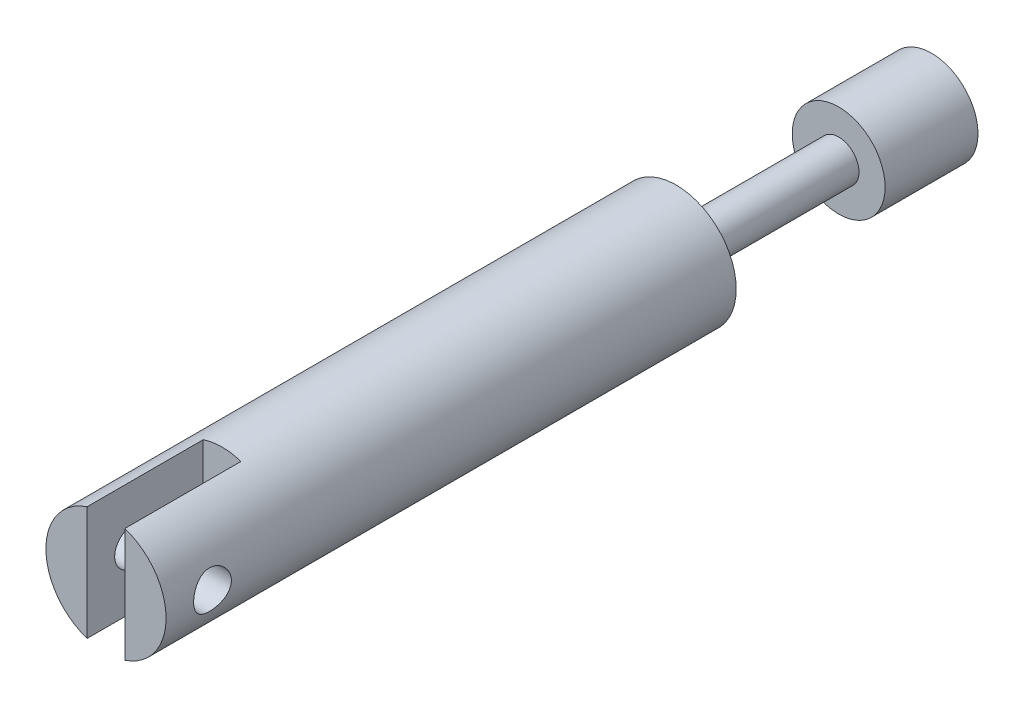
ISO-10303-21;
HEADER;
FILE_DESCRIPTION(('STEP AP214'),'2;1');
FILE_NAME('part.step','',(''),(''),'','','');
FILE_SCHEMA(('AUTOMOTIVE_DESIGN { 1 0 10303 214 1 1 1 1 }'));
ENDSEC;
DATA;
#1=APPLICATION_CONTEXT('core data for automotive mechanical design processes');
#2=APPLICATION_PROTOCOL_DEFINITION('international standard','automotive_design',2000,#1);
#3=PRODUCT_CONTEXT('',#1,'mechanical');
#4=PRODUCT('Part','Part','',(#3));
#5=PRODUCT_RELATED_PRODUCT_CATEGORY('part','',(#4));
#6=PRODUCT_DEFINITION_FORMATION('','',#4);
#7=PRODUCT_DEFINITION_CONTEXT('part definition',#1,'design');
#8=PRODUCT_DEFINITION('design','',#6,#7);
#9=PRODUCT_DEFINITION_SHAPE('','',#8);
#10=(LENGTH_UNIT() NAMED_UNIT(*) SI_UNIT(.MILLI.,.METRE.));
#11=(NAMED_UNIT(*) PLANE_ANGLE_UNIT() SI_UNIT($,.RADIAN.));
#12=(NAMED_UNIT(*) SI_UNIT($,.STERADIAN.) SOLID_ANGLE_UNIT());
#13=UNCERTAINTY_MEASURE_WITH_UNIT(LENGTH_MEASURE(1.E-05),#10,'distance_accuracy_value','');
#14=(GEOMETRIC_REPRESENTATION_CONTEXT(3) GLOBAL_UNCERTAINTY_ASSIGNED_CONTEXT((#13)) GLOBAL_UNIT_ASSIGNED_CONTEXT((#10,
#11,#12)) REPRESENTATION_CONTEXT('',''));
#15=CARTESIAN_POINT('',(0.,0.,0.));
#16=DIRECTION('',(0.,0.,1.));
#17=DIRECTION('',(1.,0.,0.));
#18=AXIS2_PLACEMENT_3D('',#15,#16,#17);
#19=CARTESIAN_POINT('',(0.,0.,0.));
#20=DIRECTION('',(0.,0.,1.));
#21=DIRECTION('',(1.,0.,0.));
#22=AXIS2_PLACEMENT_3D('',#19,#20,#21);
#23=PLANE('',#22);
#24=DIRECTION('',(0.,1.,0.));
#25=VECTOR('',#24,1.);
#26=CARTESIAN_POINT('',(1.625,-5.5,0.));
#27=LINE('',#26,#25);
#28=CARTESIAN_POINT('',(1.625,-4.9132473986153,0.));
#29=VERTEX_POINT('',#28);
#30=CARTESIAN_POINT('',(1.625,4.9132473986153,0.));
#31=VERTEX_POINT('',#30);
#32=EDGE_CURVE('E82',#29,#31,#27,.T.);
#33=ORIENTED_EDGE('',*,*,#32,.F.);
#34=CARTESIAN_POINT('',(0.,0.,0.));
#35=DIRECTION('',(0.,0.,1.));
#36=DIRECTION('',(1.,0.,0.));
#37=AXIS2_PLACEMENT_3D('',#34,#35,#36);
#38=CIRCLE('',#37,5.175);
#39=EDGE_CURVE('E89',#29,#31,#38,.T.);
#40=ORIENTED_EDGE('',*,*,#39,.T.);
#41=EDGE_LOOP('',(#33,#40));
#42=FACE_BOUND('',#41,.T.);
#43=ADVANCED_FACE('F40',(#42),#23,.T.);
#44=CARTESIAN_POINT('',(0.,0.,-71.1));
#45=DIRECTION('',(0.,0.,1.));
#46=DIRECTION('',(1.,0.,0.));
#47=AXIS2_PLACEMENT_3D('',#44,#45,#46);
#48=PLANE('',#47);
#49=CARTESIAN_POINT('',(0.,0.,-71.1));
#50=DIRECTION('',(0.,0.,1.));
#51=DIRECTION('',(1.,0.,0.));
#52=AXIS2_PLACEMENT_3D('',#49,#50,#51);
#53=CIRCLE('',#52,4.);
#54=CARTESIAN_POINT('',(4.,0.,-71.1));
#55=VERTEX_POINT('',#54);
#56=EDGE_CURVE('E105',#55,#55,#53,.T.);
#57=ORIENTED_EDGE('',*,*,#56,.F.);
#58=EDGE_LOOP('',(#57));
#59=FACE_BOUND('',#58,.T.);
#60=ADVANCED_FACE('F139',(#59),#48,.F.);
#61=CARTESIAN_POINT('',(0.,0.,-49.1));
#62=DIRECTION('',(0.,0.,1.));
#63=DIRECTION('',(1.,0.,0.));
#64=AXIS2_PLACEMENT_3D('',#61,#62,#63);
#65=CYLINDRICAL_SURFACE('',#64,4.);
#66=ORIENTED_EDGE('',*,*,#56,.T.);
#67=EDGE_LOOP('',(#66));
#68=FACE_BOUND('',#67,.T.);
#69=CARTESIAN_POINT('',(0.,0.,-63.1));
#70=DIRECTION('',(0.,0.,1.));
#71=DIRECTION('',(1.,0.,0.));
#72=AXIS2_PLACEMENT_3D('',#69,#70,#71);
#73=CIRCLE('',#72,4.);
#74=CARTESIAN_POINT('',(4.,0.,-63.1));
#75=VERTEX_POINT('',#74);
#76=EDGE_CURVE('E129',#75,#75,#73,.T.);
#77=ORIENTED_EDGE('',*,*,#76,.F.);
#78=EDGE_LOOP('',(#77));
#79=FACE_BOUND('',#78,.T.);
#80=ADVANCED_FACE('F136',(#68,#79),#65,.T.);
#81=CARTESIAN_POINT('',(0.,0.,-63.1));
#82=DIRECTION('',(0.,0.,1.));
#83=DIRECTION('',(1.,0.,0.));
#84=AXIS2_PLACEMENT_3D('',#81,#82,#83);
#85=PLANE('',#84);
#86=ORIENTED_EDGE('',*,*,#76,.T.);
#87=EDGE_LOOP('',(#86));
#88=FACE_BOUND('',#87,.T.);
#89=CARTESIAN_POINT('',(0.,0.,-63.1));
#90=DIRECTION('',(0.,0.,1.));
#91=DIRECTION('',(1.,0.,0.));
#92=AXIS2_PLACEMENT_3D('',#89,#90,#91);
#93=CIRCLE('',#92,1.75);
#94=CARTESIAN_POINT('',(1.75,0.,-63.1));
#95=VERTEX_POINT('',#94);
#96=EDGE_CURVE('E127',#95,#95,#93,.T.);
#97=ORIENTED_EDGE('',*,*,#96,.F.);
#98=EDGE_LOOP('',(#97));
#99=FACE_BOUND('',#98,.T.);
#100=ADVANCED_FACE('F146',(#88,#99),#85,.T.);
#101=CARTESIAN_POINT('',(0.,0.,-49.1));
#102=DIRECTION('',(0.,0.,1.));
#103=DIRECTION('',(1.,0.,0.));
#104=AXIS2_PLACEMENT_3D('',#101,#102,#103);
#105=CYLINDRICAL_SURFACE('',#104,1.75);
#106=ORIENTED_EDGE('',*,*,#96,.T.);
#107=EDGE_LOOP('',(#106));
#108=FACE_BOUND('',#107,.T.);
#109=CARTESIAN_POINT('',(0.,0.,-49.1));
#110=DIRECTION('',(0.,0.,1.));
#111=DIRECTION('',(1.,0.,0.));
#112=AXIS2_PLACEMENT_3D('',#109,#110,#111);
#113=CIRCLE('',#112,1.75);
#114=CARTESIAN_POINT('',(1.75,0.,-49.1));
#115=VERTEX_POINT('',#114);
#116=EDGE_CURVE('E109',#115,#115,#113,.T.);
#117=ORIENTED_EDGE('',*,*,#116,.F.);
#118=EDGE_LOOP('',(#117));
#119=FACE_BOUND('',#118,.T.);
#120=ADVANCED_FACE('F150',(#108,#119),#105,.T.);
#121=DIRECTION('',(0.,-1.,0.));
#122=VECTOR('',#121,1.);
#123=CARTESIAN_POINT('',(-1.625,-5.5,0.));
#124=LINE('',#123,#122);
#125=CARTESIAN_POINT('',(-1.625,4.9132473986153,0.));
#126=VERTEX_POINT('',#125);
#127=CARTESIAN_POINT('',(-1.625,-4.9132473986153,0.));
#128=VERTEX_POINT('',#127);
#129=EDGE_CURVE('E90',#126,#128,#124,.T.);
#130=ORIENTED_EDGE('',*,*,#129,.F.);
#131=EDGE_CURVE('E97',#126,#128,#38,.T.);
#132=ORIENTED_EDGE('',*,*,#131,.T.);
#133=EDGE_LOOP('',(#130,#132));
#134=FACE_BOUND('',#133,.T.);
#135=ADVANCED_FACE('F121',(#134),#23,.T.);
#136=CARTESIAN_POINT('',(0.,0.,-49.1));
#137=DIRECTION('',(0.,0.,1.));
#138=DIRECTION('',(1.,0.,0.));
#139=AXIS2_PLACEMENT_3D('',#136,#137,#138);
#140=CYLINDRICAL_SURFACE('',#139,5.175);
#141=CARTESIAN_POINT('',(-5.175,0.,-5.625));
#142=CARTESIAN_POINT('',(-5.17499959983047,-0.0889493776523155,-5.62499948440877));
#143=CARTESIAN_POINT('',(-5.17268505675241,-0.177904241665492,-5.61767257760745));
#144=CARTESIAN_POINT('',(-5.16367873147391,-0.353211227384269,-5.58863625969267));
#145=CARTESIAN_POINT('',(-5.15698599691395,-0.439562778532089,-5.56692371935274));
#146=CARTESIAN_POINT('',(-5.13995414666757,-0.607109890595455,-5.50992147272883));
#147=CARTESIAN_POINT('',(-5.1296207094183,-0.688313249788196,-5.47465290216195));
#148=CARTESIAN_POINT('',(-5.10637352802269,-0.843653451679668,-5.3916300613458));
#149=CARTESIAN_POINT('',(-5.09345936979124,-0.917789157527114,-5.34387378702389));
#150=CARTESIAN_POINT('',(-5.06597076052829,-1.05919938443934,-5.2356653912615));
#151=CARTESIAN_POINT('',(-5.05135987802509,-1.12622286992396,-5.17489449962652));
#152=CARTESIAN_POINT('',(-5.02233481509282,-1.24931396060239,-5.04306058729802));
#153=CARTESIAN_POINT('',(-5.00792067220902,-1.30537950106856,-4.97199563135086));
#154=CARTESIAN_POINT('',(-4.98052949600537,-1.40632942653925,-4.81941153311028));
#155=CARTESIAN_POINT('',(-4.96759738840324,-1.45089931208157,-4.73767548649231));
#156=CARTESIAN_POINT('',(-4.94518287407581,-1.52555621007292,-4.56739636124243));
#157=CARTESIAN_POINT('',(-4.93569954877889,-1.55564707965025,-4.47885510277774));
#158=CARTESIAN_POINT('',(-4.92163758993859,-1.59957156723524,-4.30031328367556));
#159=CARTESIAN_POINT('',(-4.91691873741038,-1.61387119844563,-4.21043872321179));
#160=CARTESIAN_POINT('',(-4.91250380140087,-1.62726325588285,-4.0294517757376));
#161=CARTESIAN_POINT('',(-4.91280636774864,-1.62635976995875,-3.93833972804902));
#162=CARTESIAN_POINT('',(-4.91827637600034,-1.60973553686012,-3.76132726450667));
#163=CARTESIAN_POINT('',(-4.92324895093923,-1.59460827957634,-3.6753640726806));
#164=CARTESIAN_POINT('',(-4.93718196386765,-1.55092858896977,-3.50726342403781));
#165=CARTESIAN_POINT('',(-4.9461428294196,-1.52237471623574,-3.42512637844409));
#166=CARTESIAN_POINT('',(-4.96719135901205,-1.45223539816551,-3.2656004079079));
#167=CARTESIAN_POINT('',(-4.97932310152659,-1.41046434222798,-3.18829915667181));
#168=CARTESIAN_POINT('',(-5.00532637080404,-1.31520528425443,-3.04160901253025));
#169=CARTESIAN_POINT('',(-5.01919835276622,-1.26171421383878,-2.97222219892577));
#170=CARTESIAN_POINT('',(-5.04789976764213,-1.14162562887212,-2.8399767279075));
#171=CARTESIAN_POINT('',(-5.06274389375816,-1.07453849677679,-2.77756504341678));
#172=CARTESIAN_POINT('',(-5.09115470603233,-0.930665538842489,-2.66476868132937));
#173=CARTESIAN_POINT('',(-5.10472129566394,-0.853878981171001,-2.61438491208219));
#174=CARTESIAN_POINT('',(-5.12919328803005,-0.691919377393082,-2.52676778355));
#175=CARTESIAN_POINT('',(-5.14007671744089,-0.606684612838595,-2.48964195773188));
#176=CARTESIAN_POINT('',(-5.15779745097689,-0.430758215311956,-2.43038849985547));
#177=CARTESIAN_POINT('',(-5.16463599599958,-0.340068265308212,-2.40825626773007));
#178=CARTESIAN_POINT('',(-5.17329634969086,-0.15959915935493,-2.38038179255371));
#179=CARTESIAN_POINT('',(-5.17530324612896,-0.0699221971993209,-2.37403453788453));
#180=CARTESIAN_POINT('',(-5.17462212762041,0.109225618040898,-2.37620312590349));
#181=CARTESIAN_POINT('',(-5.17193480589307,0.198696499604779,-2.38471677400566));
#182=CARTESIAN_POINT('',(-5.16228886759816,0.372552593156562,-2.41588026091358));
#183=CARTESIAN_POINT('',(-5.15543934067453,0.457009112972064,-2.43816929922527));
#184=CARTESIAN_POINT('',(-5.13827154794756,0.620959413438734,-2.49580985009886));
#185=CARTESIAN_POINT('',(-5.12795285253228,0.700452577995752,-2.53116298053452));
#186=CARTESIAN_POINT('',(-5.1045919516232,0.854388458077668,-2.61489695183573));
#187=CARTESIAN_POINT('',(-5.09148915672815,0.928659491034174,-2.66357604221924));
#188=CARTESIAN_POINT('',(-5.06405747823764,1.06818115113378,-2.77222282447313));
#189=CARTESIAN_POINT('',(-5.04972825964499,1.13342930086743,-2.8321936060668));
#190=CARTESIAN_POINT('',(-5.02073633599312,1.25576499066225,-2.96456719404252));
#191=CARTESIAN_POINT('',(-5.00608324554366,1.31242125979291,-3.03737158452511));
#192=CARTESIAN_POINT('',(-4.97870168489054,1.41275210970802,-3.1917726601381));
#193=CARTESIAN_POINT('',(-4.9659731869061,1.45642687788442,-3.2733692183277));
#194=CARTESIAN_POINT('',(-4.94402224849047,1.52928751257111,-3.44288247036985));
#195=CARTESIAN_POINT('',(-4.93478665135213,1.55852787886185,-3.53077393384997));
#196=CARTESIAN_POINT('',(-4.92094971504254,1.6016874094143,-3.7105829766703));
#197=CARTESIAN_POINT('',(-4.91634659035592,1.61561247691511,-3.80249899054379));
#198=CARTESIAN_POINT('',(-4.91248305571621,1.62731954769172,-3.98323596671762));
#199=CARTESIAN_POINT('',(-4.91298829292194,1.62580961556396,-4.07200661795501));
#200=CARTESIAN_POINT('',(-4.91871453231315,1.60840119334225,-4.24796282375275));
#201=CARTESIAN_POINT('',(-4.92393531050341,1.59250338669369,-4.33514845340331));
#202=CARTESIAN_POINT('',(-4.93833984226244,1.5472464749726,-4.50418009843994));
#203=CARTESIAN_POINT('',(-4.94746327448843,1.51809185824698,-4.58608639377386));
#204=CARTESIAN_POINT('',(-4.96862922388875,1.44731023360019,-4.7439100104367));
#205=CARTESIAN_POINT('',(-4.98067233886488,1.40568067103514,-4.8198261010532));
#206=CARTESIAN_POINT('',(-5.00691340583145,1.3092105192683,-4.96675649521953));
#207=CARTESIAN_POINT('',(-5.02117762173442,1.25391355708287,-5.03745929003676));
#208=CARTESIAN_POINT('',(-5.04995092122263,1.13247909042643,-5.168811349176));
#209=CARTESIAN_POINT('',(-5.06446006961637,1.06633867516089,-5.22945790520503));
#210=CARTESIAN_POINT('',(-5.09266432135441,0.922462279729688,-5.34098551224747));
#211=CARTESIAN_POINT('',(-5.10631661089813,0.844415062170003,-5.39147709331462));
#212=CARTESIAN_POINT('',(-5.13072870470507,0.680512221895123,-5.47855718936791));
#213=CARTESIAN_POINT('',(-5.14148961841177,0.594659611142506,-5.51515103925682));
#214=CARTESIAN_POINT('',(-5.15817998919953,0.424829628253835,-5.57081708651198));
#215=CARTESIAN_POINT('',(-5.16443239020534,0.341272271316685,-5.59107670008895));
#216=CARTESIAN_POINT('',(-5.17284216494167,0.171811322465354,-5.61816701567929));
#217=CARTESIAN_POINT('',(-5.17500038648783,0.0859082200423746,-5.62500049796329));
#218=CARTESIAN_POINT('',(-5.175,0.,-5.625));
#219=B_SPLINE_CURVE_WITH_KNOTS('',3,(#141,#142,#143,#144,#145,#146,#147,#148,#149,#150,#151,
#152,#153,#154,#155,#156,#157,#158,#159,#160,#161,#162,#163,#164,#165,#166,#167,#168,#169,#170,
#171,#172,#173,#174,#175,#176,#177,#178,#179,#180,#181,#182,#183,#184,#185,#186,#187,#188,#189,
#190,#191,#192,#193,#194,#195,#196,#197,#198,#199,#200,#201,#202,#203,#204,#205,#206,#207,#208,
#209,#210,#211,#212,#213,#214,#215,#216,#217,#218),.UNSPECIFIED.,.T.,.F.,(4,2,2,2,2,2,2,2,2,2,2,
2,2,2,2,2,2,2,2,2,2,2,2,2,2,2,2,2,2,2,2,2,2,2,2,2,2,2,4),(0.,0.266532336360352,0.53312266905361,
0.799299025804361,1.06551812576102,1.33921069029247,1.61295477515592,1.89354108429096,
2.17405260537466,2.44604432297749,2.71796290799117,2.97901654963654,3.24009818413283,
3.50502235906277,3.77001597600068,4.04719632817766,4.3243976064288,4.60379872697632,
4.88311408778565,5.15154633647776,5.41993894775222,5.68158350781141,5.9432604811301,
6.21135528996232,6.47952356394074,6.75842757626405,7.03732756232702,7.31516629781155,
7.59289790356026,7.85794821396332,8.12298593474397,8.38406726116075,8.64520208890234,
8.91663832190983,9.18814753837283,9.46863950815224,9.74902369677562,10.0064966802002,
10.2639163407396),.UNSPECIFIED.);
#220=CARTESIAN_POINT('',(-5.175,0.,-5.625));
#221=VERTEX_POINT('',#220);
#222=EDGE_CURVE('E161',#221,#221,#219,.T.);
#223=ORIENTED_EDGE('',*,*,#222,.F.);
#224=EDGE_LOOP('',(#223));
#225=FACE_BOUND('',#224,.T.);
#226=CARTESIAN_POINT('',(5.175,0.,-5.625));
#227=CARTESIAN_POINT('',(5.17499959983047,0.0889493776523155,-5.62499948440877));
#228=CARTESIAN_POINT('',(5.17268505675241,0.177904241665492,-5.61767257760745));
#229=CARTESIAN_POINT('',(5.16367873147391,0.353211227384269,-5.58863625969267));
#230=CARTESIAN_POINT('',(5.15698599691395,0.439562778532089,-5.56692371935274));
#231=CARTESIAN_POINT('',(5.13995414666757,0.607109890595455,-5.50992147272883));
#232=CARTESIAN_POINT('',(5.1296207094183,0.688313249788196,-5.47465290216195));
#233=CARTESIAN_POINT('',(5.10637352802269,0.843653451679668,-5.3916300613458));
#234=CARTESIAN_POINT('',(5.09345936979124,0.917789157527114,-5.34387378702389));
#235=CARTESIAN_POINT('',(5.06597076052829,1.05919938443934,-5.2356653912615));
#236=CARTESIAN_POINT('',(5.05135987802509,1.12622286992396,-5.17489449962652));
#237=CARTESIAN_POINT('',(5.02233481509282,1.24931396060239,-5.04306058729802));
#238=CARTESIAN_POINT('',(5.00792067220902,1.30537950106856,-4.97199563135086));
#239=CARTESIAN_POINT('',(4.98052949600537,1.40632942653925,-4.81941153311028));
#240=CARTESIAN_POINT('',(4.96759738840324,1.45089931208157,-4.73767548649231));
#241=CARTESIAN_POINT('',(4.94518287407581,1.52555621007292,-4.56739636124243));
#242=CARTESIAN_POINT('',(4.93569954877889,1.55564707965025,-4.47885510277774));
#243=CARTESIAN_POINT('',(4.92163758993859,1.59957156723524,-4.30031328367556));
#244=CARTESIAN_POINT('',(4.91691873741038,1.61387119844563,-4.21043872321179));
#245=CARTESIAN_POINT('',(4.91250380140087,1.62726325588285,-4.0294517757376));
#246=CARTESIAN_POINT('',(4.91280636774864,1.62635976995875,-3.93833972804902));
#247=CARTESIAN_POINT('',(4.91827637600034,1.60973553686012,-3.76132726450667));
#248=CARTESIAN_POINT('',(4.92324895093923,1.59460827957634,-3.6753640726806));
#249=CARTESIAN_POINT('',(4.93718196386765,1.55092858896977,-3.50726342403781));
#250=CARTESIAN_POINT('',(4.9461428294196,1.52237471623574,-3.42512637844409));
#251=CARTESIAN_POINT('',(4.96719135901205,1.45223539816551,-3.2656004079079));
#252=CARTESIAN_POINT('',(4.97932310152659,1.41046434222798,-3.18829915667181));
#253=CARTESIAN_POINT('',(5.00532637080404,1.31520528425443,-3.04160901253025));
#254=CARTESIAN_POINT('',(5.01919835276622,1.26171421383878,-2.97222219892577));
#255=CARTESIAN_POINT('',(5.04789976764213,1.14162562887212,-2.8399767279075));
#256=CARTESIAN_POINT('',(5.06274389375816,1.07453849677679,-2.77756504341678));
#257=CARTESIAN_POINT('',(5.09115470603233,0.930665538842489,-2.66476868132937));
#258=CARTESIAN_POINT('',(5.10472129566394,0.853878981171001,-2.61438491208219));
#259=CARTESIAN_POINT('',(5.12919328803005,0.691919377393082,-2.52676778355));
#260=CARTESIAN_POINT('',(5.14007671744089,0.606684612838595,-2.48964195773188));
#261=CARTESIAN_POINT('',(5.15779745097689,0.430758215311956,-2.43038849985547));
#262=CARTESIAN_POINT('',(5.16463599599958,0.340068265308212,-2.40825626773007));
#263=CARTESIAN_POINT('',(5.17329634969086,0.15959915935493,-2.38038179255371));
#264=CARTESIAN_POINT('',(5.17530324612896,0.0699221971993209,-2.37403453788453));
#265=CARTESIAN_POINT('',(5.17462212762041,-0.109225618040898,-2.37620312590349));
#266=CARTESIAN_POINT('',(5.17193480589307,-0.198696499604779,-2.38471677400566));
#267=CARTESIAN_POINT('',(5.16228886759816,-0.372552593156562,-2.41588026091358));
#268=CARTESIAN_POINT('',(5.15543934067453,-0.457009112972064,-2.43816929922527));
#269=CARTESIAN_POINT('',(5.13827154794756,-0.620959413438734,-2.49580985009886));
#270=CARTESIAN_POINT('',(5.12795285253228,-0.700452577995752,-2.53116298053452));
#271=CARTESIAN_POINT('',(5.1045919516232,-0.854388458077668,-2.61489695183573));
#272=CARTESIAN_POINT('',(5.09148915672815,-0.928659491034174,-2.66357604221924));
#273=CARTESIAN_POINT('',(5.06405747823764,-1.06818115113378,-2.77222282447313));
#274=CARTESIAN_POINT('',(5.04972825964499,-1.13342930086743,-2.8321936060668));
#275=CARTESIAN_POINT('',(5.02073633599312,-1.25576499066225,-2.96456719404252));
#276=CARTESIAN_POINT('',(5.00608324554366,-1.31242125979291,-3.03737158452511));
#277=CARTESIAN_POINT('',(4.97870168489054,-1.41275210970802,-3.1917726601381));
#278=CARTESIAN_POINT('',(4.9659731869061,-1.45642687788442,-3.2733692183277));
#279=CARTESIAN_POINT('',(4.94402224849047,-1.52928751257111,-3.44288247036985));
#280=CARTESIAN_POINT('',(4.93478665135213,-1.55852787886185,-3.53077393384997));
#281=CARTESIAN_POINT('',(4.92094971504254,-1.6016874094143,-3.7105829766703));
#282=CARTESIAN_POINT('',(4.91634659035592,-1.61561247691511,-3.80249899054379));
#283=CARTESIAN_POINT('',(4.91248305571621,-1.62731954769172,-3.98323596671762));
#284=CARTESIAN_POINT('',(4.91298829292194,-1.62580961556396,-4.07200661795501));
#285=CARTESIAN_POINT('',(4.91871453231315,-1.60840119334225,-4.24796282375275));
#286=CARTESIAN_POINT('',(4.92393531050341,-1.59250338669369,-4.33514845340331));
#287=CARTESIAN_POINT('',(4.93833984226244,-1.5472464749726,-4.50418009843994));
#288=CARTESIAN_POINT('',(4.94746327448843,-1.51809185824698,-4.58608639377386));
#289=CARTESIAN_POINT('',(4.96862922388875,-1.44731023360019,-4.7439100104367));
#290=CARTESIAN_POINT('',(4.98067233886488,-1.40568067103514,-4.8198261010532));
#291=CARTESIAN_POINT('',(5.00691340583145,-1.3092105192683,-4.96675649521953));
#292=CARTESIAN_POINT('',(5.02117762173442,-1.25391355708287,-5.03745929003676));
#293=CARTESIAN_POINT('',(5.04995092122263,-1.13247909042643,-5.168811349176));
#294=CARTESIAN_POINT('',(5.06446006961637,-1.06633867516089,-5.22945790520503));
#295=CARTESIAN_POINT('',(5.09266432135441,-0.922462279729688,-5.34098551224747));
#296=CARTESIAN_POINT('',(5.10631661089813,-0.844415062170003,-5.39147709331462));
#297=CARTESIAN_POINT('',(5.13072870470507,-0.680512221895123,-5.47855718936791));
#298=CARTESIAN_POINT('',(5.14148961841177,-0.594659611142506,-5.51515103925682));
#299=CARTESIAN_POINT('',(5.15817998919953,-0.424829628253835,-5.57081708651198));
#300=CARTESIAN_POINT('',(5.16443239020534,-0.341272271316685,-5.59107670008895));
#301=CARTESIAN_POINT('',(5.17284216494167,-0.171811322465354,-5.61816701567929));
#302=CARTESIAN_POINT('',(5.17500038648783,-0.0859082200423746,-5.62500049796329));
#303=CARTESIAN_POINT('',(5.175,0.,-5.625));
#304=B_SPLINE_CURVE_WITH_KNOTS('',3,(#226,#227,#228,#229,#230,#231,#232,#233,#234,#235,#236,
#237,#238,#239,#240,#241,#242,#243,#244,#245,#246,#247,#248,#249,#250,#251,#252,#253,#254,#255,
#256,#257,#258,#259,#260,#261,#262,#263,#264,#265,#266,#267,#268,#269,#270,#271,#272,#273,#274,
#275,#276,#277,#278,#279,#280,#281,#282,#283,#284,#285,#286,#287,#288,#289,#290,#291,#292,#293,
#294,#295,#296,#297,#298,#299,#300,#301,#302,#303),.UNSPECIFIED.,.T.,.F.,(4,2,2,2,2,2,2,2,2,2,2,
2,2,2,2,2,2,2,2,2,2,2,2,2,2,2,2,2,2,2,2,2,2,2,2,2,2,2,4),(0.,0.266532336360352,0.53312266905361,
0.799299025804361,1.06551812576102,1.33921069029247,1.61295477515592,1.89354108429096,
2.17405260537466,2.44604432297749,2.71796290799117,2.97901654963654,3.24009818413283,
3.50502235906277,3.77001597600068,4.04719632817766,4.3243976064288,4.60379872697632,
4.88311408778565,5.15154633647776,5.41993894775222,5.68158350781141,5.9432604811301,
6.21135528996232,6.47952356394074,6.75842757626405,7.03732756232702,7.31516629781155,
7.59289790356026,7.85794821396332,8.12298593474397,8.38406726116075,8.64520208890234,
8.91663832190983,9.18814753837283,9.46863950815224,9.74902369677562,10.0064966802002,
10.2639163407396),.UNSPECIFIED.);
#305=CARTESIAN_POINT('',(5.175,0.,-5.625));
#306=VERTEX_POINT('',#305);
#307=EDGE_CURVE('E91',#306,#306,#304,.T.);
#308=ORIENTED_EDGE('',*,*,#307,.F.);
#309=EDGE_LOOP('',(#308));
#310=FACE_BOUND('',#309,.T.);
#311=DIRECTION('',(0.,0.,1.));
#312=VECTOR('',#311,1.);
#313=CARTESIAN_POINT('',(1.625,-4.9132473986153,-49.1));
#314=LINE('',#313,#312);
#315=CARTESIAN_POINT('',(1.625,-4.9132473986153,-10.));
#316=VERTEX_POINT('',#315);
#317=EDGE_CURVE('E11',#316,#29,#314,.T.);
#318=ORIENTED_EDGE('',*,*,#317,.F.);
#319=CARTESIAN_POINT('',(0.,0.,-10.));
#320=DIRECTION('',(0.,0.,-1.));
#321=DIRECTION('',(-1.,0.,0.));
#322=AXIS2_PLACEMENT_3D('',#319,#320,#321);
#323=CIRCLE('',#322,5.175);
#324=CARTESIAN_POINT('',(-1.625,-4.9132473986153,-10.));
#325=VERTEX_POINT('',#324);
#326=EDGE_CURVE('E113',#325,#316,#323,.F.);
#327=ORIENTED_EDGE('',*,*,#326,.F.);
#328=DIRECTION('',(0.,0.,1.));
#329=VECTOR('',#328,1.);
#330=CARTESIAN_POINT('',(-1.625,-4.9132473986153,-49.1));
#331=LINE('',#330,#329);
#332=EDGE_CURVE('E49',#128,#325,#331,.F.);
#333=ORIENTED_EDGE('',*,*,#332,.F.);
#334=ORIENTED_EDGE('',*,*,#131,.F.);
#335=DIRECTION('',(0.,0.,1.));
#336=VECTOR('',#335,1.);
#337=CARTESIAN_POINT('',(-1.625,4.9132473986153,-49.1));
#338=LINE('',#337,#336);
#339=CARTESIAN_POINT('',(-1.625,4.9132473986153,-10.));
#340=VERTEX_POINT('',#339);
#341=EDGE_CURVE('E112',#340,#126,#338,.T.);
#342=ORIENTED_EDGE('',*,*,#341,.F.);
#343=CARTESIAN_POINT('',(1.625,4.9132473986153,-10.));
#344=VERTEX_POINT('',#343);
#345=EDGE_CURVE('E110',#344,#340,#323,.F.);
#346=ORIENTED_EDGE('',*,*,#345,.F.);
#347=DIRECTION('',(0.,0.,1.));
#348=VECTOR('',#347,1.);
#349=CARTESIAN_POINT('',(1.625,4.9132473986153,-49.1));
#350=LINE('',#349,#348);
#351=EDGE_CURVE('E96',#31,#344,#350,.F.);
#352=ORIENTED_EDGE('',*,*,#351,.F.);
#353=ORIENTED_EDGE('',*,*,#39,.F.);
#354=EDGE_LOOP('',(#318,#327,#333,#334,#342,#346,#352,#353));
#355=FACE_BOUND('',#354,.T.);
#356=CARTESIAN_POINT('',(0.,0.,-49.1));
#357=DIRECTION('',(0.,0.,1.));
#358=DIRECTION('',(1.,0.,0.));
#359=AXIS2_PLACEMENT_3D('',#356,#357,#358);
#360=CIRCLE('',#359,5.175);
#361=CARTESIAN_POINT('',(5.175,0.,-49.1));
#362=VERTEX_POINT('',#361);
#363=EDGE_CURVE('E101',#362,#362,#360,.T.);
#364=ORIENTED_EDGE('',*,*,#363,.T.);
#365=EDGE_LOOP('',(#364));
#366=FACE_BOUND('',#365,.T.);
#367=ADVANCED_FACE('F93',(#225,#310,#355,#366),#140,.T.);
#368=CARTESIAN_POINT('',(0.,0.,-49.1));
#369=DIRECTION('',(0.,0.,1.));
#370=DIRECTION('',(1.,0.,0.));
#371=AXIS2_PLACEMENT_3D('',#368,#369,#370);
#372=PLANE('',#371);
#373=ORIENTED_EDGE('',*,*,#116,.T.);
#374=EDGE_LOOP('',(#373));
#375=FACE_BOUND('',#374,.T.);
#376=ORIENTED_EDGE('',*,*,#363,.F.);
#377=EDGE_LOOP('',(#376));
#378=FACE_BOUND('',#377,.T.);
#379=ADVANCED_FACE('F42',(#375,#378),#372,.F.);
#380=CARTESIAN_POINT('',(1.625,-5.5,-10.));
#381=DIRECTION('',(1.,0.,0.));
#382=DIRECTION('',(0.,0.,-1.));
#383=AXIS2_PLACEMENT_3D('',#380,#381,#382);
#384=PLANE('',#383);
#385=CARTESIAN_POINT('',(1.625,0.,-4.));
#386=DIRECTION('',(1.,0.,0.));
#387=DIRECTION('',(0.,0.,-1.));
#388=AXIS2_PLACEMENT_3D('',#385,#386,#387);
#389=CIRCLE('',#388,1.625);
#390=CARTESIAN_POINT('',(1.625,0.,-5.625));
#391=VERTEX_POINT('',#390);
#392=EDGE_CURVE('E281',#391,#391,#389,.T.);
#393=ORIENTED_EDGE('',*,*,#392,.T.);
#394=EDGE_LOOP('',(#393));
#395=FACE_BOUND('',#394,.T.);
#396=ORIENTED_EDGE('',*,*,#351,.T.);
#397=DIRECTION('',(0.,1.,0.));
#398=VECTOR('',#397,1.);
#399=CARTESIAN_POINT('',(1.625,-5.5,-10.));
#400=LINE('',#399,#398);
#401=EDGE_CURVE('E56',#316,#344,#400,.T.);
#402=ORIENTED_EDGE('',*,*,#401,.F.);
#403=ORIENTED_EDGE('',*,*,#317,.T.);
#404=ORIENTED_EDGE('',*,*,#32,.T.);
#405=EDGE_LOOP('',(#396,#402,#403,#404));
#406=FACE_BOUND('',#405,.T.);
#407=ADVANCED_FACE('F81',(#395,#406),#384,.F.);
#408=CARTESIAN_POINT('',(-1.625,-5.5,-10.));
#409=DIRECTION('',(-1.,0.,0.));
#410=DIRECTION('',(0.,0.,1.));
#411=AXIS2_PLACEMENT_3D('',#408,#409,#410);
#412=PLANE('',#411);
#413=CARTESIAN_POINT('',(-1.625,0.,-4.));
#414=DIRECTION('',(-1.,0.,0.));
#415=DIRECTION('',(0.,0.,1.));
#416=AXIS2_PLACEMENT_3D('',#413,#414,#415);
#417=CIRCLE('',#416,1.625);
#418=CARTESIAN_POINT('',(-1.625,0.,-2.375));
#419=VERTEX_POINT('',#418);
#420=EDGE_CURVE('E44',#419,#419,#417,.T.);
#421=ORIENTED_EDGE('',*,*,#420,.T.);
#422=EDGE_LOOP('',(#421));
#423=FACE_BOUND('',#422,.T.);
#424=ORIENTED_EDGE('',*,*,#332,.T.);
#425=DIRECTION('',(0.,-1.,0.));
#426=VECTOR('',#425,1.);
#427=CARTESIAN_POINT('',(-1.625,-5.5,-10.));
#428=LINE('',#427,#426);
#429=EDGE_CURVE('E98',#340,#325,#428,.T.);
#430=ORIENTED_EDGE('',*,*,#429,.F.);
#431=ORIENTED_EDGE('',*,*,#341,.T.);
#432=ORIENTED_EDGE('',*,*,#129,.T.);
#433=EDGE_LOOP('',(#424,#430,#431,#432));
#434=FACE_BOUND('',#433,.T.);
#435=ADVANCED_FACE('F181',(#423,#434),#412,.F.);
#436=CARTESIAN_POINT('',(0.,0.,-10.));
#437=DIRECTION('',(0.,0.,-1.));
#438=DIRECTION('',(-1.,0.,0.));
#439=AXIS2_PLACEMENT_3D('',#436,#437,#438);
#440=PLANE('',#439);
#441=ORIENTED_EDGE('',*,*,#326,.T.);
#442=ORIENTED_EDGE('',*,*,#401,.T.);
#443=ORIENTED_EDGE('',*,*,#345,.T.);
#444=ORIENTED_EDGE('',*,*,#429,.T.);
#445=EDGE_LOOP('',(#441,#442,#443,#444));
#446=FACE_BOUND('',#445,.T.);
#447=ADVANCED_FACE('F116',(#446),#440,.F.);
#448=CARTESIAN_POINT('',(-6.825,0.,-4.));
#449=DIRECTION('',(1.,0.,0.));
#450=DIRECTION('',(0.,0.,-1.));
#451=AXIS2_PLACEMENT_3D('',#448,#449,#450);
#452=CYLINDRICAL_SURFACE('',#451,1.625);
#453=ORIENTED_EDGE('',*,*,#222,.T.);
#454=EDGE_LOOP('',(#453));
#455=FACE_BOUND('',#454,.T.);
#456=ORIENTED_EDGE('',*,*,#420,.F.);
#457=EDGE_LOOP('',(#456));
#458=FACE_BOUND('',#457,.T.);
#459=ADVANCED_FACE('F176',(#455,#458),#452,.F.);
#460=ORIENTED_EDGE('',*,*,#307,.T.);
#461=EDGE_LOOP('',(#460));
#462=FACE_BOUND('',#461,.T.);
#463=ORIENTED_EDGE('',*,*,#392,.F.);
#464=EDGE_LOOP('',(#463));
#465=FACE_BOUND('',#464,.T.);
#466=ADVANCED_FACE('F172',(#462,#465),#452,.F.);
#467=CLOSED_SHELL('',(#43,#60,#80,#100,#120,#135,#367,#379,#407,#435,#447,#459,#466));
#468=MANIFOLD_SOLID_BREP('B2',#467);
#469=ADVANCED_BREP_SHAPE_REPRESENTATION('',(#18,#468),#14);
#470=SHAPE_DEFINITION_REPRESENTATION(#9,#469);
ENDSEC;
END-ISO-10303-21;
